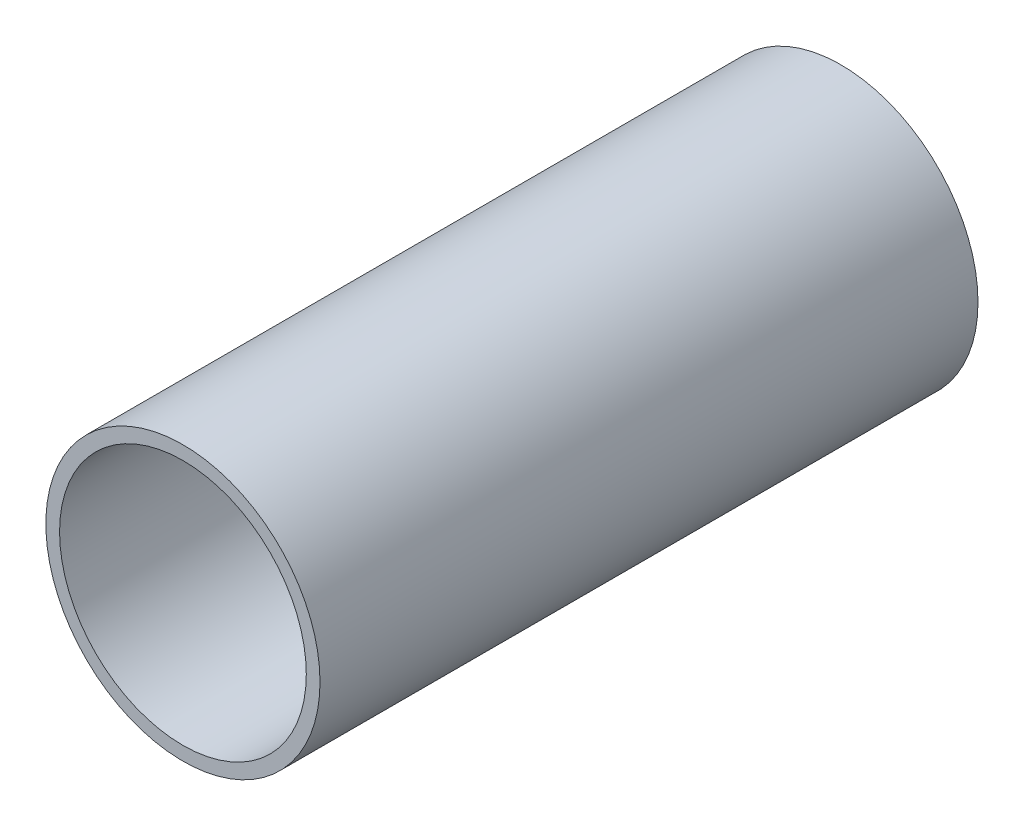
ISO-10303-21;
HEADER;
FILE_DESCRIPTION(('STEP AP214'),'2;1');
FILE_NAME('part.step','',(''),(''),'','','');
FILE_SCHEMA(('AUTOMOTIVE_DESIGN { 1 0 10303 214 1 1 1 1 }'));
ENDSEC;
DATA;
#1=APPLICATION_CONTEXT('core data for automotive mechanical design processes');
#2=APPLICATION_PROTOCOL_DEFINITION('international standard','automotive_design',2000,#1);
#3=PRODUCT_CONTEXT('',#1,'mechanical');
#4=PRODUCT('Part','Part','',(#3));
#5=PRODUCT_RELATED_PRODUCT_CATEGORY('part','',(#4));
#6=PRODUCT_DEFINITION_FORMATION('','',#4);
#7=PRODUCT_DEFINITION_CONTEXT('part definition',#1,'design');
#8=PRODUCT_DEFINITION('design','',#6,#7);
#9=PRODUCT_DEFINITION_SHAPE('','',#8);
#10=(LENGTH_UNIT() NAMED_UNIT(*) SI_UNIT(.MILLI.,.METRE.));
#11=(NAMED_UNIT(*) PLANE_ANGLE_UNIT() SI_UNIT($,.RADIAN.));
#12=(NAMED_UNIT(*) SI_UNIT($,.STERADIAN.) SOLID_ANGLE_UNIT());
#13=UNCERTAINTY_MEASURE_WITH_UNIT(LENGTH_MEASURE(1.E-05),#10,'distance_accuracy_value','');
#14=(GEOMETRIC_REPRESENTATION_CONTEXT(3) GLOBAL_UNCERTAINTY_ASSIGNED_CONTEXT((#13)) GLOBAL_UNIT_ASSIGNED_CONTEXT((#10,
#11,#12)) REPRESENTATION_CONTEXT('',''));
#15=CARTESIAN_POINT('',(0.,0.,0.));
#16=DIRECTION('',(0.,0.,1.));
#17=DIRECTION('',(1.,0.,0.));
#18=AXIS2_PLACEMENT_3D('',#15,#16,#17);
#19=CARTESIAN_POINT('',(0.,0.,152.4));
#20=DIRECTION('',(0.,0.,1.));
#21=DIRECTION('',(1.,0.,0.));
#22=AXIS2_PLACEMENT_3D('',#19,#20,#21);
#23=PLANE('',#22);
#24=CARTESIAN_POINT('',(0.,0.,152.4));
#25=DIRECTION('',(0.,0.,1.));
#26=DIRECTION('',(1.,0.,0.));
#27=AXIS2_PLACEMENT_3D('',#24,#25,#26);
#28=CIRCLE('',#27,31.75);
#29=CARTESIAN_POINT('',(31.75,0.,152.4));
#30=VERTEX_POINT('',#29);
#31=EDGE_CURVE('E10',#30,#30,#28,.T.);
#32=ORIENTED_EDGE('',*,*,#31,.T.);
#33=EDGE_LOOP('',(#32));
#34=FACE_BOUND('',#33,.T.);
#35=CARTESIAN_POINT('',(0.,0.,152.4));
#36=DIRECTION('',(0.,0.,1.));
#37=DIRECTION('',(1.,0.,0.));
#38=AXIS2_PLACEMENT_3D('',#35,#36,#37);
#39=CIRCLE('',#38,28.575);
#40=CARTESIAN_POINT('',(28.575,0.,152.4));
#41=VERTEX_POINT('',#40);
#42=EDGE_CURVE('E44',#41,#41,#39,.T.);
#43=ORIENTED_EDGE('',*,*,#42,.F.);
#44=EDGE_LOOP('',(#43));
#45=FACE_BOUND('',#44,.T.);
#46=ADVANCED_FACE('F33',(#34,#45),#23,.T.);
#47=CARTESIAN_POINT('',(0.,0.,0.));
#48=DIRECTION('',(0.,0.,1.));
#49=DIRECTION('',(1.,0.,0.));
#50=AXIS2_PLACEMENT_3D('',#47,#48,#49);
#51=PLANE('',#50);
#52=CARTESIAN_POINT('',(0.,0.,0.));
#53=DIRECTION('',(0.,0.,1.));
#54=DIRECTION('',(1.,0.,0.));
#55=AXIS2_PLACEMENT_3D('',#52,#53,#54);
#56=CIRCLE('',#55,31.75);
#57=CARTESIAN_POINT('',(31.75,0.,0.));
#58=VERTEX_POINT('',#57);
#59=EDGE_CURVE('E37',#58,#58,#56,.T.);
#60=ORIENTED_EDGE('',*,*,#59,.F.);
#61=EDGE_LOOP('',(#60));
#62=FACE_BOUND('',#61,.T.);
#63=CARTESIAN_POINT('',(0.,0.,0.));
#64=DIRECTION('',(0.,0.,1.));
#65=DIRECTION('',(1.,0.,0.));
#66=AXIS2_PLACEMENT_3D('',#63,#64,#65);
#67=CIRCLE('',#66,28.575);
#68=CARTESIAN_POINT('',(28.575,0.,0.));
#69=VERTEX_POINT('',#68);
#70=EDGE_CURVE('E46',#69,#69,#67,.T.);
#71=ORIENTED_EDGE('',*,*,#70,.T.);
#72=EDGE_LOOP('',(#71));
#73=FACE_BOUND('',#72,.T.);
#74=ADVANCED_FACE('F56',(#62,#73),#51,.F.);
#75=CARTESIAN_POINT('',(0.,0.,152.4));
#76=DIRECTION('',(0.,0.,-1.));
#77=DIRECTION('',(-1.,0.,0.));
#78=AXIS2_PLACEMENT_3D('',#75,#76,#77);
#79=CYLINDRICAL_SURFACE('',#78,31.75);
#80=ORIENTED_EDGE('',*,*,#31,.F.);
#81=EDGE_LOOP('',(#80));
#82=FACE_BOUND('',#81,.T.);
#83=ORIENTED_EDGE('',*,*,#59,.T.);
#84=EDGE_LOOP('',(#83));
#85=FACE_BOUND('',#84,.T.);
#86=ADVANCED_FACE('F35',(#82,#85),#79,.T.);
#87=CARTESIAN_POINT('',(0.,0.,152.4));
#88=DIRECTION('',(0.,0.,-1.));
#89=DIRECTION('',(-1.,0.,0.));
#90=AXIS2_PLACEMENT_3D('',#87,#88,#89);
#91=CYLINDRICAL_SURFACE('',#90,28.575);
#92=ORIENTED_EDGE('',*,*,#42,.T.);
#93=EDGE_LOOP('',(#92));
#94=FACE_BOUND('',#93,.T.);
#95=ORIENTED_EDGE('',*,*,#70,.F.);
#96=EDGE_LOOP('',(#95));
#97=FACE_BOUND('',#96,.T.);
#98=ADVANCED_FACE('F52',(#94,#97),#91,.F.);
#99=CLOSED_SHELL('',(#46,#74,#86,#98));
#100=MANIFOLD_SOLID_BREP('B2',#99);
#101=ADVANCED_BREP_SHAPE_REPRESENTATION('',(#18,#100),#14);
#102=SHAPE_DEFINITION_REPRESENTATION(#9,#101);
ENDSEC;
END-ISO-10303-21;
